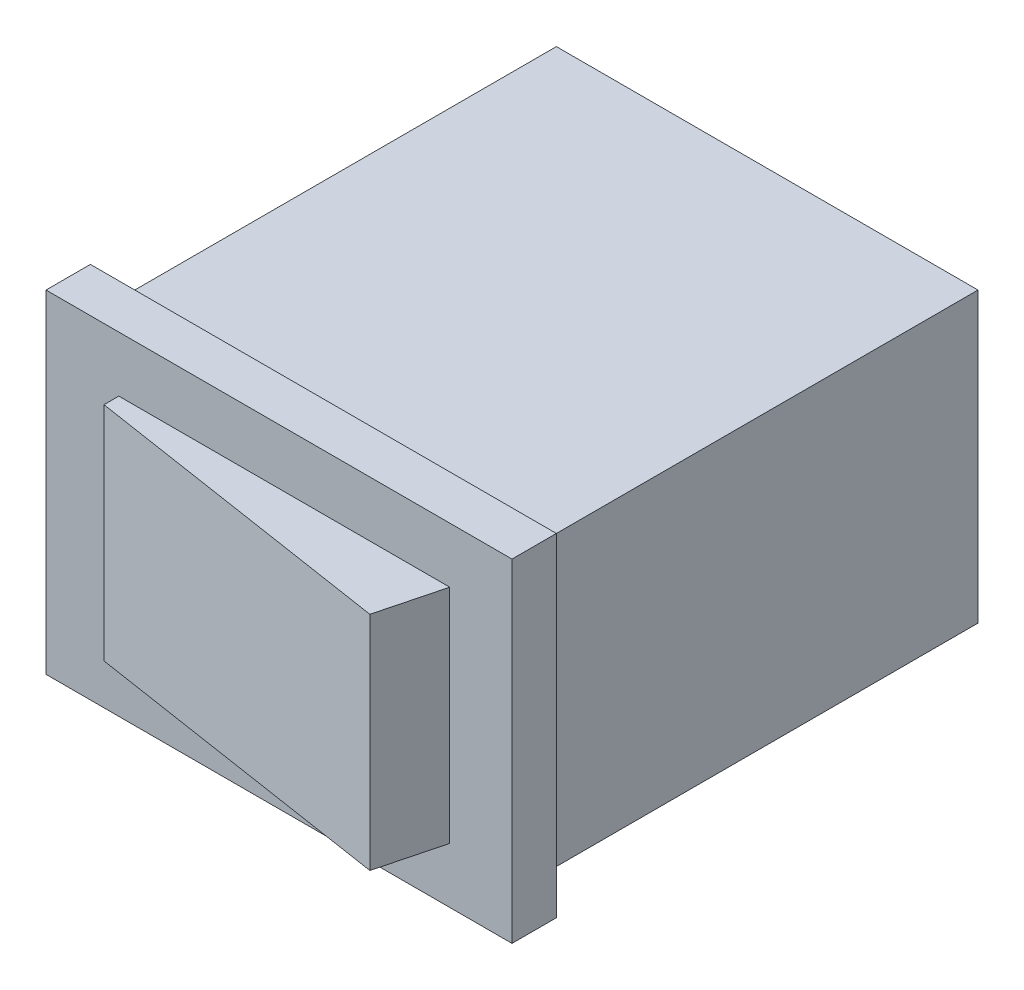
ISO-10303-21;
HEADER;
FILE_DESCRIPTION(('STEP AP214'),'2;1');
FILE_NAME('part.step','',(''),(''),'','','');
FILE_SCHEMA(('AUTOMOTIVE_DESIGN { 1 0 10303 214 1 1 1 1 }'));
ENDSEC;
DATA;
#1=APPLICATION_CONTEXT('core data for automotive mechanical design processes');
#2=APPLICATION_PROTOCOL_DEFINITION('international standard','automotive_design',2000,#1);
#3=PRODUCT_CONTEXT('',#1,'mechanical');
#4=PRODUCT('Part','Part','',(#3));
#5=PRODUCT_RELATED_PRODUCT_CATEGORY('part','',(#4));
#6=PRODUCT_DEFINITION_FORMATION('','',#4);
#7=PRODUCT_DEFINITION_CONTEXT('part definition',#1,'design');
#8=PRODUCT_DEFINITION('design','',#6,#7);
#9=PRODUCT_DEFINITION_SHAPE('','',#8);
#10=(LENGTH_UNIT() NAMED_UNIT(*) SI_UNIT(.MILLI.,.METRE.));
#11=(NAMED_UNIT(*) PLANE_ANGLE_UNIT() SI_UNIT($,.RADIAN.));
#12=(NAMED_UNIT(*) SI_UNIT($,.STERADIAN.) SOLID_ANGLE_UNIT());
#13=UNCERTAINTY_MEASURE_WITH_UNIT(LENGTH_MEASURE(1.E-05),#10,'distance_accuracy_value','');
#14=(GEOMETRIC_REPRESENTATION_CONTEXT(3) GLOBAL_UNCERTAINTY_ASSIGNED_CONTEXT((#13)) GLOBAL_UNIT_ASSIGNED_CONTEXT((#10,
#11,#12)) REPRESENTATION_CONTEXT('',''));
#15=CARTESIAN_POINT('',(0.,0.,0.));
#16=DIRECTION('',(0.,0.,1.));
#17=DIRECTION('',(1.,0.,0.));
#18=AXIS2_PLACEMENT_3D('',#15,#16,#17);
#19=CARTESIAN_POINT('',(0.,0.,22.));
#20=DIRECTION('',(0.,0.,1.));
#21=DIRECTION('',(1.,0.,0.));
#22=AXIS2_PLACEMENT_3D('',#19,#20,#21);
#23=PLANE('',#22);
#24=DIRECTION('',(0.,1.,0.));
#25=VECTOR('',#24,1.);
#26=CARTESIAN_POINT('',(10.5,7.5,22.));
#27=LINE('',#26,#25);
#28=CARTESIAN_POINT('',(10.5,-7.5,22.));
#29=VERTEX_POINT('',#28);
#30=CARTESIAN_POINT('',(10.5,7.5,22.));
#31=VERTEX_POINT('',#30);
#32=EDGE_CURVE('E168',#29,#31,#27,.T.);
#33=ORIENTED_EDGE('',*,*,#32,.T.);
#34=DIRECTION('',(-1.,0.,0.));
#35=VECTOR('',#34,1.);
#36=CARTESIAN_POINT('',(-10.5,7.5,22.));
#37=LINE('',#36,#35);
#38=CARTESIAN_POINT('',(-10.5,7.5,22.));
#39=VERTEX_POINT('',#38);
#40=EDGE_CURVE('E171',#31,#39,#37,.T.);
#41=ORIENTED_EDGE('',*,*,#40,.T.);
#42=DIRECTION('',(0.,-1.,0.));
#43=VECTOR('',#42,1.);
#44=CARTESIAN_POINT('',(-10.5,7.5,22.));
#45=LINE('',#44,#43);
#46=CARTESIAN_POINT('',(-10.5,-7.5,22.));
#47=VERTEX_POINT('',#46);
#48=EDGE_CURVE('E174',#39,#47,#45,.T.);
#49=ORIENTED_EDGE('',*,*,#48,.T.);
#50=DIRECTION('',(1.,0.,0.));
#51=VECTOR('',#50,1.);
#52=CARTESIAN_POINT('',(-10.5,-7.5,22.));
#53=LINE('',#52,#51);
#54=EDGE_CURVE('E176',#47,#29,#53,.T.);
#55=ORIENTED_EDGE('',*,*,#54,.T.);
#56=EDGE_LOOP('',(#33,#41,#49,#55));
#57=FACE_BOUND('',#56,.T.);
#58=DIRECTION('',(-1.,0.,0.));
#59=VECTOR('',#58,1.);
#60=CARTESIAN_POINT('',(7.69464276705317,-5.,22.));
#61=LINE('',#60,#59);
#62=CARTESIAN_POINT('',(7.69464276705317,-5.,22.));
#63=VERTEX_POINT('',#62);
#64=CARTESIAN_POINT('',(-7.21867104686149,-5.,22.));
#65=VERTEX_POINT('',#64);
#66=EDGE_CURVE('E158',#63,#65,#61,.T.);
#67=ORIENTED_EDGE('',*,*,#66,.T.);
#68=DIRECTION('',(0.,1.,0.));
#69=VECTOR('',#68,1.);
#70=CARTESIAN_POINT('',(-7.21867104686149,-5.,22.));
#71=LINE('',#70,#69);
#72=CARTESIAN_POINT('',(-7.21867104686149,5.,22.));
#73=VERTEX_POINT('',#72);
#74=EDGE_CURVE('E141',#65,#73,#71,.T.);
#75=ORIENTED_EDGE('',*,*,#74,.T.);
#76=DIRECTION('',(-1.,0.,0.));
#77=VECTOR('',#76,1.);
#78=CARTESIAN_POINT('',(7.69464276705317,5.,22.));
#79=LINE('',#78,#77);
#80=CARTESIAN_POINT('',(7.69464276705317,5.,22.));
#81=VERTEX_POINT('',#80);
#82=EDGE_CURVE('E148',#81,#73,#79,.T.);
#83=ORIENTED_EDGE('',*,*,#82,.F.);
#84=DIRECTION('',(0.,1.,0.));
#85=VECTOR('',#84,1.);
#86=CARTESIAN_POINT('',(7.69464276705317,-5.,22.));
#87=LINE('',#86,#85);
#88=EDGE_CURVE('E183',#63,#81,#87,.T.);
#89=ORIENTED_EDGE('',*,*,#88,.F.);
#90=EDGE_LOOP('',(#67,#75,#83,#89));
#91=FACE_BOUND('',#90,.T.);
#92=ADVANCED_FACE('F38',(#57,#91),#23,.T.);
#93=CARTESIAN_POINT('',(9.5,6.5,20.));
#94=DIRECTION('',(-1.,0.,0.));
#95=DIRECTION('',(0.,0.,1.));
#96=AXIS2_PLACEMENT_3D('',#93,#94,#95);
#97=PLANE('',#96);
#98=DIRECTION('',(0.,1.,0.));
#99=VECTOR('',#98,1.);
#100=CARTESIAN_POINT('',(9.5,6.5,0.));
#101=LINE('',#100,#99);
#102=CARTESIAN_POINT('',(9.5,-6.5,0.));
#103=VERTEX_POINT('',#102);
#104=CARTESIAN_POINT('',(9.5,6.5,0.));
#105=VERTEX_POINT('',#104);
#106=EDGE_CURVE('E199',#103,#105,#101,.T.);
#107=ORIENTED_EDGE('',*,*,#106,.T.);
#108=DIRECTION('',(0.,0.,-1.));
#109=VECTOR('',#108,1.);
#110=CARTESIAN_POINT('',(9.5,6.5,20.));
#111=LINE('',#110,#109);
#112=CARTESIAN_POINT('',(9.5,6.5,20.));
#113=VERTEX_POINT('',#112);
#114=EDGE_CURVE('E11',#113,#105,#111,.T.);
#115=ORIENTED_EDGE('',*,*,#114,.F.);
#116=DIRECTION('',(0.,1.,0.));
#117=VECTOR('',#116,1.);
#118=CARTESIAN_POINT('',(9.5,6.5,20.));
#119=LINE('',#118,#117);
#120=CARTESIAN_POINT('',(9.5,-6.5,20.));
#121=VERTEX_POINT('',#120);
#122=EDGE_CURVE('E200',#121,#113,#119,.T.);
#123=ORIENTED_EDGE('',*,*,#122,.F.);
#124=DIRECTION('',(0.,0.,-1.));
#125=VECTOR('',#124,1.);
#126=CARTESIAN_POINT('',(9.5,-6.5,20.));
#127=LINE('',#126,#125);
#128=EDGE_CURVE('E210',#121,#103,#127,.T.);
#129=ORIENTED_EDGE('',*,*,#128,.T.);
#130=EDGE_LOOP('',(#107,#115,#123,#129));
#131=FACE_BOUND('',#130,.T.);
#132=ADVANCED_FACE('F40',(#131),#97,.F.);
#133=CARTESIAN_POINT('',(-9.5,6.5,20.));
#134=DIRECTION('',(0.,-1.,0.));
#135=DIRECTION('',(0.,0.,-1.));
#136=AXIS2_PLACEMENT_3D('',#133,#134,#135);
#137=PLANE('',#136);
#138=DIRECTION('',(-1.,0.,0.));
#139=VECTOR('',#138,1.);
#140=CARTESIAN_POINT('',(-9.5,6.5,0.));
#141=LINE('',#140,#139);
#142=CARTESIAN_POINT('',(-9.5,6.5,0.));
#143=VERTEX_POINT('',#142);
#144=EDGE_CURVE('E213',#105,#143,#141,.T.);
#145=ORIENTED_EDGE('',*,*,#144,.T.);
#146=DIRECTION('',(0.,0.,-1.));
#147=VECTOR('',#146,1.);
#148=CARTESIAN_POINT('',(-9.5,6.5,20.));
#149=LINE('',#148,#147);
#150=CARTESIAN_POINT('',(-9.5,6.5,20.));
#151=VERTEX_POINT('',#150);
#152=EDGE_CURVE('E46',#151,#143,#149,.T.);
#153=ORIENTED_EDGE('',*,*,#152,.F.);
#154=DIRECTION('',(-1.,0.,0.));
#155=VECTOR('',#154,1.);
#156=CARTESIAN_POINT('',(-9.5,6.5,20.));
#157=LINE('',#156,#155);
#158=EDGE_CURVE('E87',#113,#151,#157,.T.);
#159=ORIENTED_EDGE('',*,*,#158,.F.);
#160=ORIENTED_EDGE('',*,*,#114,.T.);
#161=EDGE_LOOP('',(#145,#153,#159,#160));
#162=FACE_BOUND('',#161,.T.);
#163=ADVANCED_FACE('F249',(#162),#137,.F.);
#164=CARTESIAN_POINT('',(-9.5,6.5,20.));
#165=DIRECTION('',(1.,0.,0.));
#166=DIRECTION('',(0.,1.,0.));
#167=AXIS2_PLACEMENT_3D('',#164,#165,#166);
#168=PLANE('',#167);
#169=DIRECTION('',(0.,-1.,0.));
#170=VECTOR('',#169,1.);
#171=CARTESIAN_POINT('',(-9.5,6.5,0.));
#172=LINE('',#171,#170);
#173=CARTESIAN_POINT('',(-9.5,-6.5,0.));
#174=VERTEX_POINT('',#173);
#175=EDGE_CURVE('E215',#143,#174,#172,.T.);
#176=ORIENTED_EDGE('',*,*,#175,.T.);
#177=DIRECTION('',(0.,0.,-1.));
#178=VECTOR('',#177,1.);
#179=CARTESIAN_POINT('',(-9.5,-6.5,20.));
#180=LINE('',#179,#178);
#181=CARTESIAN_POINT('',(-9.5,-6.5,20.));
#182=VERTEX_POINT('',#181);
#183=EDGE_CURVE('E62',#182,#174,#180,.T.);
#184=ORIENTED_EDGE('',*,*,#183,.F.);
#185=DIRECTION('',(0.,-1.,0.));
#186=VECTOR('',#185,1.);
#187=CARTESIAN_POINT('',(-9.5,6.5,20.));
#188=LINE('',#187,#186);
#189=EDGE_CURVE('E204',#151,#182,#188,.T.);
#190=ORIENTED_EDGE('',*,*,#189,.F.);
#191=ORIENTED_EDGE('',*,*,#152,.T.);
#192=EDGE_LOOP('',(#176,#184,#190,#191));
#193=FACE_BOUND('',#192,.T.);
#194=ADVANCED_FACE('F221',(#193),#168,.F.);
#195=CARTESIAN_POINT('',(-9.5,-6.5,20.));
#196=DIRECTION('',(0.,1.,0.));
#197=DIRECTION('',(0.,0.,1.));
#198=AXIS2_PLACEMENT_3D('',#195,#196,#197);
#199=PLANE('',#198);
#200=DIRECTION('',(1.,0.,0.));
#201=VECTOR('',#200,1.);
#202=CARTESIAN_POINT('',(-9.5,-6.5,0.));
#203=LINE('',#202,#201);
#204=EDGE_CURVE('E82',#174,#103,#203,.T.);
#205=ORIENTED_EDGE('',*,*,#204,.T.);
#206=ORIENTED_EDGE('',*,*,#128,.F.);
#207=DIRECTION('',(1.,0.,0.));
#208=VECTOR('',#207,1.);
#209=CARTESIAN_POINT('',(-9.5,-6.5,20.));
#210=LINE('',#209,#208);
#211=EDGE_CURVE('E207',#182,#121,#210,.T.);
#212=ORIENTED_EDGE('',*,*,#211,.F.);
#213=ORIENTED_EDGE('',*,*,#183,.T.);
#214=EDGE_LOOP('',(#205,#206,#212,#213));
#215=FACE_BOUND('',#214,.T.);
#216=ADVANCED_FACE('F226',(#215),#199,.F.);
#217=CARTESIAN_POINT('',(0.,0.,0.));
#218=DIRECTION('',(0.,0.,1.));
#219=DIRECTION('',(1.,0.,0.));
#220=AXIS2_PLACEMENT_3D('',#217,#218,#219);
#221=PLANE('',#220);
#222=ORIENTED_EDGE('',*,*,#106,.F.);
#223=ORIENTED_EDGE('',*,*,#204,.F.);
#224=ORIENTED_EDGE('',*,*,#175,.F.);
#225=ORIENTED_EDGE('',*,*,#144,.F.);
#226=EDGE_LOOP('',(#222,#223,#224,#225));
#227=FACE_BOUND('',#226,.T.);
#228=ADVANCED_FACE('F224',(#227),#221,.F.);
#229=CARTESIAN_POINT('',(0.,0.,20.));
#230=DIRECTION('',(0.,0.,1.));
#231=DIRECTION('',(1.,0.,0.));
#232=AXIS2_PLACEMENT_3D('',#229,#230,#231);
#233=PLANE('',#232);
#234=DIRECTION('',(0.,1.,0.));
#235=VECTOR('',#234,1.);
#236=CARTESIAN_POINT('',(10.5,7.5,20.));
#237=LINE('',#236,#235);
#238=CARTESIAN_POINT('',(10.5,-7.5,20.));
#239=VERTEX_POINT('',#238);
#240=CARTESIAN_POINT('',(10.5,7.5,20.));
#241=VERTEX_POINT('',#240);
#242=EDGE_CURVE('E179',#239,#241,#237,.T.);
#243=ORIENTED_EDGE('',*,*,#242,.F.);
#244=DIRECTION('',(1.,0.,0.));
#245=VECTOR('',#244,1.);
#246=CARTESIAN_POINT('',(-10.5,-7.5,20.));
#247=LINE('',#246,#245);
#248=CARTESIAN_POINT('',(-10.5,-7.5,20.));
#249=VERTEX_POINT('',#248);
#250=EDGE_CURVE('E172',#249,#239,#247,.T.);
#251=ORIENTED_EDGE('',*,*,#250,.F.);
#252=DIRECTION('',(0.,-1.,0.));
#253=VECTOR('',#252,1.);
#254=CARTESIAN_POINT('',(-10.5,7.5,20.));
#255=LINE('',#254,#253);
#256=CARTESIAN_POINT('',(-10.5,7.5,20.));
#257=VERTEX_POINT('',#256);
#258=EDGE_CURVE('E185',#257,#249,#255,.T.);
#259=ORIENTED_EDGE('',*,*,#258,.F.);
#260=DIRECTION('',(-1.,0.,0.));
#261=VECTOR('',#260,1.);
#262=CARTESIAN_POINT('',(-10.5,7.5,20.));
#263=LINE('',#262,#261);
#264=EDGE_CURVE('E182',#241,#257,#263,.T.);
#265=ORIENTED_EDGE('',*,*,#264,.F.);
#266=EDGE_LOOP('',(#243,#251,#259,#265));
#267=FACE_BOUND('',#266,.T.);
#268=ORIENTED_EDGE('',*,*,#211,.T.);
#269=ORIENTED_EDGE('',*,*,#122,.T.);
#270=ORIENTED_EDGE('',*,*,#158,.T.);
#271=ORIENTED_EDGE('',*,*,#189,.T.);
#272=EDGE_LOOP('',(#268,#269,#270,#271));
#273=FACE_BOUND('',#272,.T.);
#274=ADVANCED_FACE('F228',(#267,#273),#233,.F.);
#275=CARTESIAN_POINT('',(10.5,7.5,22.));
#276=DIRECTION('',(-1.,0.,0.));
#277=DIRECTION('',(0.,0.,1.));
#278=AXIS2_PLACEMENT_3D('',#275,#276,#277);
#279=PLANE('',#278);
#280=ORIENTED_EDGE('',*,*,#242,.T.);
#281=DIRECTION('',(0.,0.,-1.));
#282=VECTOR('',#281,1.);
#283=CARTESIAN_POINT('',(10.5,7.5,22.));
#284=LINE('',#283,#282);
#285=EDGE_CURVE('E196',#31,#241,#284,.T.);
#286=ORIENTED_EDGE('',*,*,#285,.F.);
#287=ORIENTED_EDGE('',*,*,#32,.F.);
#288=DIRECTION('',(0.,0.,-1.));
#289=VECTOR('',#288,1.);
#290=CARTESIAN_POINT('',(10.5,-7.5,22.));
#291=LINE('',#290,#289);
#292=EDGE_CURVE('E178',#29,#239,#291,.T.);
#293=ORIENTED_EDGE('',*,*,#292,.T.);
#294=EDGE_LOOP('',(#280,#286,#287,#293));
#295=FACE_BOUND('',#294,.T.);
#296=ADVANCED_FACE('F230',(#295),#279,.F.);
#297=CARTESIAN_POINT('',(-10.5,7.5,22.));
#298=DIRECTION('',(0.,-1.,0.));
#299=DIRECTION('',(0.,0.,-1.));
#300=AXIS2_PLACEMENT_3D('',#297,#298,#299);
#301=PLANE('',#300);
#302=ORIENTED_EDGE('',*,*,#264,.T.);
#303=DIRECTION('',(0.,0.,-1.));
#304=VECTOR('',#303,1.);
#305=CARTESIAN_POINT('',(-10.5,7.5,22.));
#306=LINE('',#305,#304);
#307=EDGE_CURVE('E193',#39,#257,#306,.T.);
#308=ORIENTED_EDGE('',*,*,#307,.F.);
#309=ORIENTED_EDGE('',*,*,#40,.F.);
#310=ORIENTED_EDGE('',*,*,#285,.T.);
#311=EDGE_LOOP('',(#302,#308,#309,#310));
#312=FACE_BOUND('',#311,.T.);
#313=ADVANCED_FACE('F237',(#312),#301,.F.);
#314=CARTESIAN_POINT('',(-10.5,7.5,22.));
#315=DIRECTION('',(1.,0.,0.));
#316=DIRECTION('',(0.,0.,-1.));
#317=AXIS2_PLACEMENT_3D('',#314,#315,#316);
#318=PLANE('',#317);
#319=ORIENTED_EDGE('',*,*,#258,.T.);
#320=DIRECTION('',(0.,0.,-1.));
#321=VECTOR('',#320,1.);
#322=CARTESIAN_POINT('',(-10.5,-7.5,22.));
#323=LINE('',#322,#321);
#324=EDGE_CURVE('E190',#47,#249,#323,.T.);
#325=ORIENTED_EDGE('',*,*,#324,.F.);
#326=ORIENTED_EDGE('',*,*,#48,.F.);
#327=ORIENTED_EDGE('',*,*,#307,.T.);
#328=EDGE_LOOP('',(#319,#325,#326,#327));
#329=FACE_BOUND('',#328,.T.);
#330=ADVANCED_FACE('F290',(#329),#318,.F.);
#331=CARTESIAN_POINT('',(-10.5,-7.5,22.));
#332=DIRECTION('',(0.,1.,0.));
#333=DIRECTION('',(0.,0.,1.));
#334=AXIS2_PLACEMENT_3D('',#331,#332,#333);
#335=PLANE('',#334);
#336=ORIENTED_EDGE('',*,*,#250,.T.);
#337=ORIENTED_EDGE('',*,*,#292,.F.);
#338=ORIENTED_EDGE('',*,*,#54,.F.);
#339=ORIENTED_EDGE('',*,*,#324,.T.);
#340=EDGE_LOOP('',(#336,#337,#338,#339));
#341=FACE_BOUND('',#340,.T.);
#342=ADVANCED_FACE('F261',(#341),#335,.F.);
#343=CARTESIAN_POINT('',(6.95268685591314,-5.,24.8579106081118));
#344=DIRECTION('',(0.96791324245952,0.,0.25128460969884));
#345=DIRECTION('',(0.25128460969884,0.,-0.96791324245952));
#346=AXIS2_PLACEMENT_3D('',#343,#344,#345);
#347=PLANE('',#346);
#348=ORIENTED_EDGE('',*,*,#88,.T.);
#349=DIRECTION('',(0.25128460969884,0.,-0.96791324245952));
#350=VECTOR('',#349,1.);
#351=CARTESIAN_POINT('',(6.95268685591314,5.,24.8579106081118));
#352=LINE('',#351,#350);
#353=CARTESIAN_POINT('',(6.95268685591314,5.,24.8579106081118));
#354=VERTEX_POINT('',#353);
#355=EDGE_CURVE('E154',#354,#81,#352,.T.);
#356=ORIENTED_EDGE('',*,*,#355,.F.);
#357=DIRECTION('',(0.,1.,0.));
#358=VECTOR('',#357,1.);
#359=CARTESIAN_POINT('',(6.95268685591314,-5.,24.8579106081118));
#360=LINE('',#359,#358);
#361=CARTESIAN_POINT('',(6.95268685591314,-5.,24.8579106081118));
#362=VERTEX_POINT('',#361);
#363=EDGE_CURVE('E161',#362,#354,#360,.T.);
#364=ORIENTED_EDGE('',*,*,#363,.F.);
#365=DIRECTION('',(0.25128460969884,0.,-0.96791324245952));
#366=VECTOR('',#365,1.);
#367=CARTESIAN_POINT('',(6.95268685591314,-5.,24.8579106081118));
#368=LINE('',#367,#366);
#369=EDGE_CURVE('E159',#362,#63,#368,.T.);
#370=ORIENTED_EDGE('',*,*,#369,.T.);
#371=EDGE_LOOP('',(#348,#356,#364,#370));
#372=FACE_BOUND('',#371,.T.);
#373=ADVANCED_FACE('F257',(#372),#347,.T.);
#374=CARTESIAN_POINT('',(-7.21867104686149,-5.,22.6691406702487));
#375=DIRECTION('',(-0.152640382520347,0.,0.988281798691063));
#376=DIRECTION('',(0.988281798691063,0.,0.152640382520347));
#377=AXIS2_PLACEMENT_3D('',#374,#375,#376);
#378=PLANE('',#377);
#379=ORIENTED_EDGE('',*,*,#363,.T.);
#380=DIRECTION('',(0.988281798691063,0.,0.152640382520347));
#381=VECTOR('',#380,1.);
#382=CARTESIAN_POINT('',(-7.21867104686149,5.,22.6691406702487));
#383=LINE('',#382,#381);
#384=CARTESIAN_POINT('',(-7.21867104686149,5.,22.6691406702487));
#385=VERTEX_POINT('',#384);
#386=EDGE_CURVE('E147',#385,#354,#383,.T.);
#387=ORIENTED_EDGE('',*,*,#386,.F.);
#388=DIRECTION('',(0.,1.,0.));
#389=VECTOR('',#388,1.);
#390=CARTESIAN_POINT('',(-7.21867104686149,-5.,22.6691406702487));
#391=LINE('',#390,#389);
#392=CARTESIAN_POINT('',(-7.21867104686149,-5.,22.6691406702487));
#393=VERTEX_POINT('',#392);
#394=EDGE_CURVE('E143',#393,#385,#391,.T.);
#395=ORIENTED_EDGE('',*,*,#394,.F.);
#396=DIRECTION('',(0.988281798691063,0.,0.152640382520347));
#397=VECTOR('',#396,1.);
#398=CARTESIAN_POINT('',(-7.21867104686149,-5.,22.6691406702487));
#399=LINE('',#398,#397);
#400=EDGE_CURVE('E164',#393,#362,#399,.T.);
#401=ORIENTED_EDGE('',*,*,#400,.T.);
#402=EDGE_LOOP('',(#379,#387,#395,#401));
#403=FACE_BOUND('',#402,.T.);
#404=ADVANCED_FACE('F254',(#403),#378,.T.);
#405=CARTESIAN_POINT('',(-7.21867104686149,-5.,22.));
#406=DIRECTION('',(-1.,0.,0.));
#407=DIRECTION('',(0.,0.,1.));
#408=AXIS2_PLACEMENT_3D('',#405,#406,#407);
#409=PLANE('',#408);
#410=ORIENTED_EDGE('',*,*,#394,.T.);
#411=DIRECTION('',(0.,0.,1.));
#412=VECTOR('',#411,1.);
#413=CARTESIAN_POINT('',(-7.21867104686149,5.,22.));
#414=LINE('',#413,#412);
#415=EDGE_CURVE('E137',#73,#385,#414,.T.);
#416=ORIENTED_EDGE('',*,*,#415,.F.);
#417=ORIENTED_EDGE('',*,*,#74,.F.);
#418=DIRECTION('',(0.,0.,1.));
#419=VECTOR('',#418,1.);
#420=CARTESIAN_POINT('',(-7.21867104686149,-5.,22.));
#421=LINE('',#420,#419);
#422=EDGE_CURVE('E53',#65,#393,#421,.T.);
#423=ORIENTED_EDGE('',*,*,#422,.T.);
#424=EDGE_LOOP('',(#410,#416,#417,#423));
#425=FACE_BOUND('',#424,.T.);
#426=ADVANCED_FACE('F139',(#425),#409,.T.);
#427=CARTESIAN_POINT('',(0.,-5.,0.));
#428=DIRECTION('',(0.,1.,0.));
#429=DIRECTION('',(0.,0.,1.));
#430=AXIS2_PLACEMENT_3D('',#427,#428,#429);
#431=PLANE('',#430);
#432=ORIENTED_EDGE('',*,*,#66,.F.);
#433=ORIENTED_EDGE('',*,*,#369,.F.);
#434=ORIENTED_EDGE('',*,*,#400,.F.);
#435=ORIENTED_EDGE('',*,*,#422,.F.);
#436=EDGE_LOOP('',(#432,#433,#434,#435));
#437=FACE_BOUND('',#436,.T.);
#438=ADVANCED_FACE('F253',(#437),#431,.F.);
#439=CARTESIAN_POINT('',(0.,5.,0.));
#440=DIRECTION('',(0.,1.,0.));
#441=DIRECTION('',(0.,0.,1.));
#442=AXIS2_PLACEMENT_3D('',#439,#440,#441);
#443=PLANE('',#442);
#444=ORIENTED_EDGE('',*,*,#82,.T.);
#445=ORIENTED_EDGE('',*,*,#415,.T.);
#446=ORIENTED_EDGE('',*,*,#386,.T.);
#447=ORIENTED_EDGE('',*,*,#355,.T.);
#448=EDGE_LOOP('',(#444,#445,#446,#447));
#449=FACE_BOUND('',#448,.T.);
#450=ADVANCED_FACE('F152',(#449),#443,.T.);
#451=CLOSED_SHELL('',(#92,#132,#163,#194,#216,#228,#274,#296,#313,#330,#342,#373,#404,#426,#438,#450));
#452=MANIFOLD_SOLID_BREP('B2',#451);
#453=ADVANCED_BREP_SHAPE_REPRESENTATION('',(#18,#452),#14);
#454=SHAPE_DEFINITION_REPRESENTATION(#9,#453);
ENDSEC;
END-ISO-10303-21;
